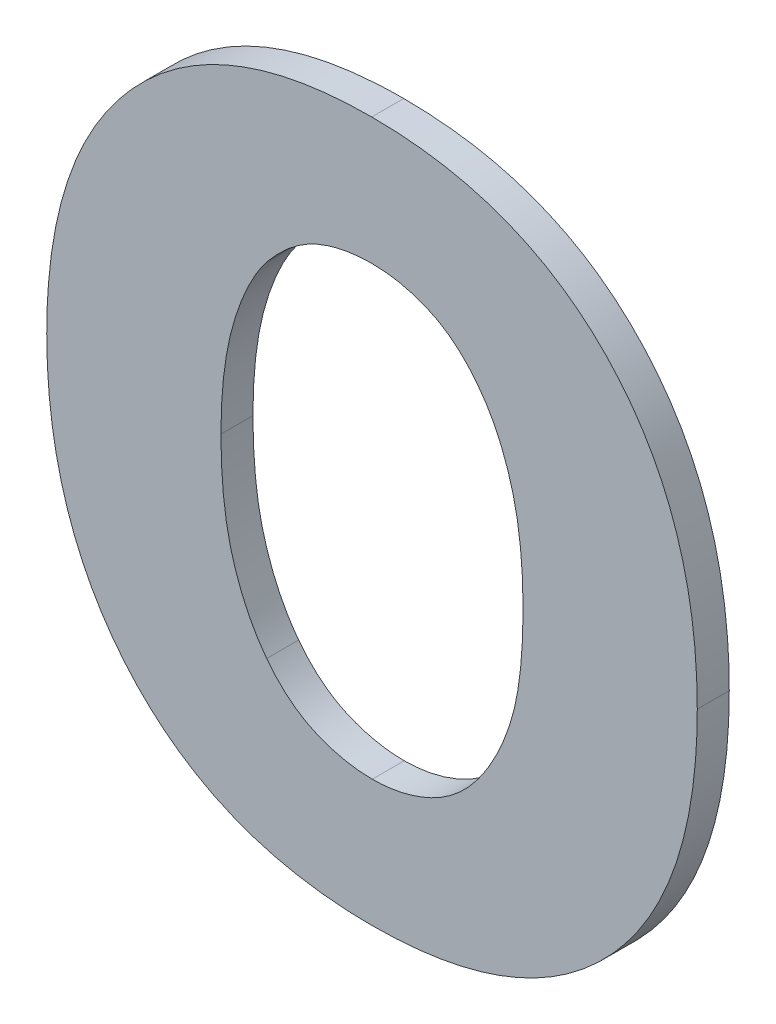
ISO-10303-21;
HEADER;
FILE_DESCRIPTION(('STEP AP214'),'2;1');
FILE_NAME('part.step','',(''),(''),'','','');
FILE_SCHEMA(('AUTOMOTIVE_DESIGN { 1 0 10303 214 1 1 1 1 }'));
ENDSEC;
DATA;
#1=APPLICATION_CONTEXT('core data for automotive mechanical design processes');
#2=APPLICATION_PROTOCOL_DEFINITION('international standard','automotive_design',2000,#1);
#3=PRODUCT_CONTEXT('',#1,'mechanical');
#4=PRODUCT('Part','Part','',(#3));
#5=PRODUCT_RELATED_PRODUCT_CATEGORY('part','',(#4));
#6=PRODUCT_DEFINITION_FORMATION('','',#4);
#7=PRODUCT_DEFINITION_CONTEXT('part definition',#1,'design');
#8=PRODUCT_DEFINITION('design','',#6,#7);
#9=PRODUCT_DEFINITION_SHAPE('','',#8);
#10=(LENGTH_UNIT() NAMED_UNIT(*) SI_UNIT(.MILLI.,.METRE.));
#11=(NAMED_UNIT(*) PLANE_ANGLE_UNIT() SI_UNIT($,.RADIAN.));
#12=(NAMED_UNIT(*) SI_UNIT($,.STERADIAN.) SOLID_ANGLE_UNIT());
#13=UNCERTAINTY_MEASURE_WITH_UNIT(LENGTH_MEASURE(1.E-05),#10,'distance_accuracy_value','');
#14=(GEOMETRIC_REPRESENTATION_CONTEXT(3) GLOBAL_UNCERTAINTY_ASSIGNED_CONTEXT((#13)) GLOBAL_UNIT_ASSIGNED_CONTEXT((#10,
#11,#12)) REPRESENTATION_CONTEXT('',''));
#15=CARTESIAN_POINT('',(0.,0.,0.));
#16=DIRECTION('',(0.,0.,1.));
#17=DIRECTION('',(1.,0.,0.));
#18=AXIS2_PLACEMENT_3D('',#15,#16,#17);
#19=CARTESIAN_POINT('',(3.7394580950312,-3.1596409460892,0.0475));
#20=CARTESIAN_POINT('',(3.7394580950312,-3.1596409460892,0.0525));
#21=CARTESIAN_POINT('',(3.7428616605651,-3.1550461326184,0.0475));
#22=CARTESIAN_POINT('',(3.7428616605651,-3.1550461326184,0.0525));
#23=CARTESIAN_POINT('',(3.7465204935141,-3.1428783858346,0.0475));
#24=CARTESIAN_POINT('',(3.7465204935141,-3.1428783858346,0.0525));
#25=CARTESIAN_POINT('',(3.7465204935141,-3.1330080457862,0.0475));
#26=CARTESIAN_POINT('',(3.7465204935141,-3.1330080457862,0.0525));
#27=B_SPLINE_SURFACE_WITH_KNOTS('',2,1,((#19,#20),(#21,#22),(#23,#24),(#25,#26)),.UNSPECIFIED.,
.F.,.F.,.F.,(3,1,3),(2,2),(0.,1.,2.),(0.,0.01),.UNSPECIFIED.);
#28=CARTESIAN_POINT('',(3.7394580950312,-3.1596409460892,0.0475));
#29=CARTESIAN_POINT('',(3.7428616605651,-3.1550461326184,0.0475));
#30=CARTESIAN_POINT('',(3.7465204935141,-3.1428783858346,0.0475));
#31=CARTESIAN_POINT('',(3.7465204935141,-3.1330080457862,0.0475));
#32=B_SPLINE_CURVE_WITH_KNOTS('',2,(#28,#29,#30,#31),.UNSPECIFIED.,.F.,.F.,(3,1,3),(0.,1.,2.),.UNSPECIFIED.);
#33=CARTESIAN_POINT('',(3.7394580950312,-3.1596409460892,0.0475));
#34=VERTEX_POINT('',#33);
#35=CARTESIAN_POINT('',(3.7465204935141,-3.1330080457862,0.0475));
#36=VERTEX_POINT('',#35);
#37=EDGE_CURVE('E11',#34,#36,#32,.T.);
#38=DIRECTION('',(0.,0.,1.));
#39=VECTOR('',#38,1.);
#40=CARTESIAN_POINT('',(3.7394580950312,-3.1596409460892,0.0475));
#41=LINE('',#40,#39);
#42=CARTESIAN_POINT('',(3.7394580950312,-3.1596409460892,0.0525));
#43=VERTEX_POINT('',#42);
#44=EDGE_CURVE('E28',#34,#43,#41,.T.);
#45=CARTESIAN_POINT('',(3.7465204935141,-3.1330080457862,0.0525));
#46=CARTESIAN_POINT('',(3.7465204935141,-3.1428783858346,0.0525));
#47=CARTESIAN_POINT('',(3.7428616605651,-3.1550461326184,0.0525));
#48=CARTESIAN_POINT('',(3.7394580950312,-3.1596409460892,0.0525));
#49=B_SPLINE_CURVE_WITH_KNOTS('',2,(#45,#46,#47,#48),.UNSPECIFIED.,.F.,.F.,(3,1,3),(-2.,-1.,0.),.UNSPECIFIED.);
#50=CARTESIAN_POINT('',(3.7465204935141,-3.1330080457862,0.0525));
#51=VERTEX_POINT('',#50);
#52=EDGE_CURVE('E317',#51,#43,#49,.T.);
#53=DIRECTION('',(0.,0.,1.));
#54=VECTOR('',#53,1.);
#55=CARTESIAN_POINT('',(3.7465204935141,-3.1330080457862,0.0475));
#56=LINE('',#55,#54);
#57=EDGE_CURVE('E41',#36,#51,#56,.T.);
#58=ORIENTED_EDGE('',*,*,#37,.F.);
#59=ORIENTED_EDGE('',*,*,#44,.T.);
#60=ORIENTED_EDGE('',*,*,#52,.F.);
#61=ORIENTED_EDGE('',*,*,#57,.F.);
#62=EDGE_LOOP('',(#58,#59,#60,#61));
#63=FACE_BOUND('',#62,.T.);
#64=ADVANCED_FACE('F17',(#63),#27,.F.);
#65=CARTESIAN_POINT('',(3.7229508021916,-3.167894592509,0.0475));
#66=CARTESIAN_POINT('',(3.7229508021916,-3.167894592509,0.0525));
#67=CARTESIAN_POINT('',(3.7276307048008,-3.167894592509,0.0475));
#68=CARTESIAN_POINT('',(3.7276307048008,-3.167894592509,0.0525));
#69=CARTESIAN_POINT('',(3.7363097969123,-3.1638954030066,0.0475));
#70=CARTESIAN_POINT('',(3.7363097969123,-3.1638954030066,0.0525));
#71=CARTESIAN_POINT('',(3.7394580950312,-3.1596409460892,0.0475));
#72=CARTESIAN_POINT('',(3.7394580950312,-3.1596409460892,0.0525));
#73=B_SPLINE_SURFACE_WITH_KNOTS('',2,1,((#65,#66),(#67,#68),(#69,#70),(#71,#72)),.UNSPECIFIED.,
.F.,.F.,.F.,(3,1,3),(2,2),(0.,1.,2.),(0.,0.01),.UNSPECIFIED.);
#74=CARTESIAN_POINT('',(3.7229508021916,-3.167894592509,0.0475));
#75=CARTESIAN_POINT('',(3.7276307048008,-3.167894592509,0.0475));
#76=CARTESIAN_POINT('',(3.7363097969123,-3.1638954030066,0.0475));
#77=CARTESIAN_POINT('',(3.7394580950312,-3.1596409460892,0.0475));
#78=B_SPLINE_CURVE_WITH_KNOTS('',2,(#74,#75,#76,#77),.UNSPECIFIED.,.F.,.F.,(3,1,3),(0.,1.,2.),.UNSPECIFIED.);
#79=CARTESIAN_POINT('',(3.7229508021916,-3.167894592509,0.0475));
#80=VERTEX_POINT('',#79);
#81=EDGE_CURVE('E308',#80,#34,#78,.T.);
#82=DIRECTION('',(0.,0.,1.));
#83=VECTOR('',#82,1.);
#84=CARTESIAN_POINT('',(3.7229508021916,-3.167894592509,0.0475));
#85=LINE('',#84,#83);
#86=CARTESIAN_POINT('',(3.7229508021916,-3.167894592509,0.0525));
#87=VERTEX_POINT('',#86);
#88=EDGE_CURVE('E302',#80,#87,#85,.T.);
#89=CARTESIAN_POINT('',(3.7394580950312,-3.1596409460892,0.0525));
#90=CARTESIAN_POINT('',(3.7363097969123,-3.1638954030066,0.0525));
#91=CARTESIAN_POINT('',(3.7276307048008,-3.167894592509,0.0525));
#92=CARTESIAN_POINT('',(3.7229508021916,-3.167894592509,0.0525));
#93=B_SPLINE_CURVE_WITH_KNOTS('',2,(#89,#90,#91,#92),.UNSPECIFIED.,.F.,.F.,(3,1,3),(-2.,-1.,0.),.UNSPECIFIED.);
#94=EDGE_CURVE('E295',#43,#87,#93,.T.);
#95=ORIENTED_EDGE('',*,*,#81,.F.);
#96=ORIENTED_EDGE('',*,*,#88,.T.);
#97=ORIENTED_EDGE('',*,*,#94,.F.);
#98=ORIENTED_EDGE('',*,*,#44,.F.);
#99=EDGE_LOOP('',(#95,#96,#97,#98));
#100=FACE_BOUND('',#99,.T.);
#101=ADVANCED_FACE('F323',(#100),#73,.F.);
#102=CARTESIAN_POINT('',(3.7064435093521,-3.1598111243659,0.0475));
#103=CARTESIAN_POINT('',(3.7064435093521,-3.1598111243659,0.0525));
#104=CARTESIAN_POINT('',(3.7097619857476,-3.1641506704217,0.0475));
#105=CARTESIAN_POINT('',(3.7097619857476,-3.1641506704217,0.0525));
#106=CARTESIAN_POINT('',(3.7183559887208,-3.167894592509,0.0475));
#107=CARTESIAN_POINT('',(3.7183559887208,-3.167894592509,0.0525));
#108=CARTESIAN_POINT('',(3.7229508021916,-3.167894592509,0.0475));
#109=CARTESIAN_POINT('',(3.7229508021916,-3.167894592509,0.0525));
#110=B_SPLINE_SURFACE_WITH_KNOTS('',2,1,((#102,#103),(#104,#105),(#106,#107),(#108,#109)),
.UNSPECIFIED.,.F.,.F.,.F.,(3,1,3),(2,2),(0.,1.,2.),(0.,0.01),.UNSPECIFIED.);
#111=CARTESIAN_POINT('',(3.7064435093521,-3.1598111243659,0.0475));
#112=CARTESIAN_POINT('',(3.7097619857476,-3.1641506704217,0.0475));
#113=CARTESIAN_POINT('',(3.7183559887208,-3.167894592509,0.0475));
#114=CARTESIAN_POINT('',(3.7229508021916,-3.167894592509,0.0475));
#115=B_SPLINE_CURVE_WITH_KNOTS('',2,(#111,#112,#113,#114),.UNSPECIFIED.,.F.,.F.,(3,1,3),(0.,1.,
2.),.UNSPECIFIED.);
#116=CARTESIAN_POINT('',(3.7064435093521,-3.1598111243659,0.0475));
#117=VERTEX_POINT('',#116);
#118=EDGE_CURVE('E290',#117,#80,#115,.T.);
#119=DIRECTION('',(0.,0.,1.));
#120=VECTOR('',#119,1.);
#121=CARTESIAN_POINT('',(3.7064435093521,-3.1598111243659,0.0475));
#122=LINE('',#121,#120);
#123=CARTESIAN_POINT('',(3.7064435093521,-3.1598111243659,0.0525));
#124=VERTEX_POINT('',#123);
#125=EDGE_CURVE('E284',#117,#124,#122,.T.);
#126=CARTESIAN_POINT('',(3.7229508021916,-3.167894592509,0.0525));
#127=CARTESIAN_POINT('',(3.7183559887208,-3.167894592509,0.0525));
#128=CARTESIAN_POINT('',(3.7097619857476,-3.1641506704217,0.0525));
#129=CARTESIAN_POINT('',(3.7064435093521,-3.1598111243659,0.0525));
#130=B_SPLINE_CURVE_WITH_KNOTS('',2,(#126,#127,#128,#129),.UNSPECIFIED.,.F.,.F.,(3,1,3),(-2.,
-1.,0.),.UNSPECIFIED.);
#131=EDGE_CURVE('E277',#87,#124,#130,.T.);
#132=ORIENTED_EDGE('',*,*,#118,.F.);
#133=ORIENTED_EDGE('',*,*,#125,.T.);
#134=ORIENTED_EDGE('',*,*,#131,.F.);
#135=ORIENTED_EDGE('',*,*,#88,.F.);
#136=EDGE_LOOP('',(#132,#133,#134,#135));
#137=FACE_BOUND('',#136,.T.);
#138=ADVANCED_FACE('F336',(#137),#110,.F.);
#139=CARTESIAN_POINT('',(3.6992960217308,-3.1330080457862,0.0475));
#140=CARTESIAN_POINT('',(3.6992960217308,-3.1330080457862,0.0525));
#141=CARTESIAN_POINT('',(3.6992960217308,-3.1427082075579,0.0475));
#142=CARTESIAN_POINT('',(3.6992960217308,-3.1427082075579,0.0525));
#143=CARTESIAN_POINT('',(3.7031250329565,-3.1554715783102,0.0475));
#144=CARTESIAN_POINT('',(3.7031250329565,-3.1554715783102,0.0525));
#145=CARTESIAN_POINT('',(3.7064435093521,-3.1598111243659,0.0475));
#146=CARTESIAN_POINT('',(3.7064435093521,-3.1598111243659,0.0525));
#147=B_SPLINE_SURFACE_WITH_KNOTS('',2,1,((#139,#140),(#141,#142),(#143,#144),(#145,#146)),
.UNSPECIFIED.,.F.,.F.,.F.,(3,1,3),(2,2),(0.,1.,2.),(0.,0.01),.UNSPECIFIED.);
#148=CARTESIAN_POINT('',(3.6992960217308,-3.1330080457862,0.0475));
#149=CARTESIAN_POINT('',(3.6992960217308,-3.1427082075579,0.0475));
#150=CARTESIAN_POINT('',(3.7031250329565,-3.1554715783102,0.0475));
#151=CARTESIAN_POINT('',(3.7064435093521,-3.1598111243659,0.0475));
#152=B_SPLINE_CURVE_WITH_KNOTS('',2,(#148,#149,#150,#151),.UNSPECIFIED.,.F.,.F.,(3,1,3),(0.,1.,
2.),.UNSPECIFIED.);
#153=CARTESIAN_POINT('',(3.6992960217308,-3.1330080457862,0.0475));
#154=VERTEX_POINT('',#153);
#155=EDGE_CURVE('E272',#154,#117,#152,.T.);
#156=DIRECTION('',(0.,0.,1.));
#157=VECTOR('',#156,1.);
#158=CARTESIAN_POINT('',(3.6992960217308,-3.1330080457862,0.0475));
#159=LINE('',#158,#157);
#160=CARTESIAN_POINT('',(3.6992960217308,-3.1330080457862,0.0525));
#161=VERTEX_POINT('',#160);
#162=EDGE_CURVE('E266',#154,#161,#159,.T.);
#163=CARTESIAN_POINT('',(3.7064435093521,-3.1598111243659,0.0525));
#164=CARTESIAN_POINT('',(3.7031250329565,-3.1554715783102,0.0525));
#165=CARTESIAN_POINT('',(3.6992960217308,-3.1427082075579,0.0525));
#166=CARTESIAN_POINT('',(3.6992960217308,-3.1330080457862,0.0525));
#167=B_SPLINE_CURVE_WITH_KNOTS('',2,(#163,#164,#165,#166),.UNSPECIFIED.,.F.,.F.,(3,1,3),(-2.,
-1.,0.),.UNSPECIFIED.);
#168=EDGE_CURVE('E259',#124,#161,#167,.T.);
#169=ORIENTED_EDGE('',*,*,#155,.F.);
#170=ORIENTED_EDGE('',*,*,#162,.T.);
#171=ORIENTED_EDGE('',*,*,#168,.F.);
#172=ORIENTED_EDGE('',*,*,#125,.F.);
#173=EDGE_LOOP('',(#169,#170,#171,#172));
#174=FACE_BOUND('',#173,.T.);
#175=ADVANCED_FACE('F339',(#174),#147,.F.);
#176=CARTESIAN_POINT('',(3.7065285984904,-3.1060347889298,0.0475));
#177=CARTESIAN_POINT('',(3.7065285984904,-3.1060347889298,0.0525));
#178=CARTESIAN_POINT('',(3.7032952112332,-3.1101190675706,0.0475));
#179=CARTESIAN_POINT('',(3.7032952112332,-3.1101190675706,0.0525));
#180=CARTESIAN_POINT('',(3.6992960217308,-3.1236482405679,0.0475));
#181=CARTESIAN_POINT('',(3.6992960217308,-3.1236482405679,0.0525));
#182=CARTESIAN_POINT('',(3.6992960217308,-3.1330080457862,0.0475));
#183=CARTESIAN_POINT('',(3.6992960217308,-3.1330080457862,0.0525));
#184=B_SPLINE_SURFACE_WITH_KNOTS('',2,1,((#176,#177),(#178,#179),(#180,#181),(#182,#183)),
.UNSPECIFIED.,.F.,.F.,.F.,(3,1,3),(2,2),(0.,1.,2.),(0.,0.01),.UNSPECIFIED.);
#185=CARTESIAN_POINT('',(3.7065285984904,-3.1060347889298,0.0475));
#186=CARTESIAN_POINT('',(3.7032952112332,-3.1101190675706,0.0475));
#187=CARTESIAN_POINT('',(3.6992960217308,-3.1236482405679,0.0475));
#188=CARTESIAN_POINT('',(3.6992960217308,-3.1330080457862,0.0475));
#189=B_SPLINE_CURVE_WITH_KNOTS('',2,(#185,#186,#187,#188),.UNSPECIFIED.,.F.,.F.,(3,1,3),(0.,1.,
2.),.UNSPECIFIED.);
#190=CARTESIAN_POINT('',(3.7065285984904,-3.1060347889298,0.0475));
#191=VERTEX_POINT('',#190);
#192=EDGE_CURVE('E254',#191,#154,#189,.T.);
#193=DIRECTION('',(0.,0.,1.));
#194=VECTOR('',#193,1.);
#195=CARTESIAN_POINT('',(3.7065285984904,-3.1060347889298,0.0475));
#196=LINE('',#195,#194);
#197=CARTESIAN_POINT('',(3.7065285984904,-3.1060347889298,0.0525));
#198=VERTEX_POINT('',#197);
#199=EDGE_CURVE('E248',#191,#198,#196,.T.);
#200=CARTESIAN_POINT('',(3.6992960217308,-3.1330080457862,0.0525));
#201=CARTESIAN_POINT('',(3.6992960217308,-3.1236482405679,0.0525));
#202=CARTESIAN_POINT('',(3.7032952112332,-3.1101190675706,0.0525));
#203=CARTESIAN_POINT('',(3.7065285984904,-3.1060347889298,0.0525));
#204=B_SPLINE_CURVE_WITH_KNOTS('',2,(#200,#201,#202,#203),.UNSPECIFIED.,.F.,.F.,(3,1,3),(-2.,
-1.,0.),.UNSPECIFIED.);
#205=EDGE_CURVE('E241',#161,#198,#204,.T.);
#206=ORIENTED_EDGE('',*,*,#192,.F.);
#207=ORIENTED_EDGE('',*,*,#199,.T.);
#208=ORIENTED_EDGE('',*,*,#205,.F.);
#209=ORIENTED_EDGE('',*,*,#162,.F.);
#210=EDGE_LOOP('',(#206,#207,#208,#209));
#211=FACE_BOUND('',#210,.T.);
#212=ADVANCED_FACE('F344',(#211),#184,.F.);
#213=CARTESIAN_POINT('',(3.7229508021916,-3.0981214990634,0.0475));
#214=CARTESIAN_POINT('',(3.7229508021916,-3.0981214990634,0.0525));
#215=CARTESIAN_POINT('',(3.7181007213058,-3.0981214990634,0.0475));
#216=CARTESIAN_POINT('',(3.7181007213058,-3.0981214990634,0.0525));
#217=CARTESIAN_POINT('',(3.7101874314394,-3.1016101537357,0.0475));
#218=CARTESIAN_POINT('',(3.7101874314394,-3.1016101537357,0.0525));
#219=CARTESIAN_POINT('',(3.7065285984904,-3.1060347889298,0.0475));
#220=CARTESIAN_POINT('',(3.7065285984904,-3.1060347889298,0.0525));
#221=B_SPLINE_SURFACE_WITH_KNOTS('',2,1,((#213,#214),(#215,#216),(#217,#218),(#219,#220)),
.UNSPECIFIED.,.F.,.F.,.F.,(3,1,3),(2,2),(0.,1.,2.),(0.,0.01),.UNSPECIFIED.);
#222=CARTESIAN_POINT('',(3.7229508021916,-3.0981214990634,0.0475));
#223=CARTESIAN_POINT('',(3.7181007213058,-3.0981214990634,0.0475));
#224=CARTESIAN_POINT('',(3.7101874314394,-3.1016101537357,0.0475));
#225=CARTESIAN_POINT('',(3.7065285984904,-3.1060347889298,0.0475));
#226=B_SPLINE_CURVE_WITH_KNOTS('',2,(#222,#223,#224,#225),.UNSPECIFIED.,.F.,.F.,(3,1,3),(0.,1.,
2.),.UNSPECIFIED.);
#227=CARTESIAN_POINT('',(3.7229508021916,-3.0981214990634,0.0475));
#228=VERTEX_POINT('',#227);
#229=EDGE_CURVE('E236',#228,#191,#226,.T.);
#230=DIRECTION('',(0.,0.,1.));
#231=VECTOR('',#230,1.);
#232=CARTESIAN_POINT('',(3.7229508021916,-3.0981214990634,0.0475));
#233=LINE('',#232,#231);
#234=CARTESIAN_POINT('',(3.7229508021916,-3.0981214990634,0.0525));
#235=VERTEX_POINT('',#234);
#236=EDGE_CURVE('E230',#228,#235,#233,.T.);
#237=CARTESIAN_POINT('',(3.7065285984904,-3.1060347889298,0.0525));
#238=CARTESIAN_POINT('',(3.7101874314394,-3.1016101537357,0.0525));
#239=CARTESIAN_POINT('',(3.7181007213058,-3.0981214990634,0.0525));
#240=CARTESIAN_POINT('',(3.7229508021916,-3.0981214990634,0.0525));
#241=B_SPLINE_CURVE_WITH_KNOTS('',2,(#237,#238,#239,#240),.UNSPECIFIED.,.F.,.F.,(3,1,3),(-2.,
-1.,0.),.UNSPECIFIED.);
#242=EDGE_CURVE('E223',#198,#235,#241,.T.);
#243=ORIENTED_EDGE('',*,*,#229,.F.);
#244=ORIENTED_EDGE('',*,*,#236,.T.);
#245=ORIENTED_EDGE('',*,*,#242,.F.);
#246=ORIENTED_EDGE('',*,*,#199,.F.);
#247=EDGE_LOOP('',(#243,#244,#245,#246));
#248=FACE_BOUND('',#247,.T.);
#249=ADVANCED_FACE('F347',(#248),#221,.F.);
#250=CARTESIAN_POINT('',(3.7393730058928,-3.1062049672065,0.0475));
#251=CARTESIAN_POINT('',(3.7393730058928,-3.1062049672065,0.0525));
#252=CARTESIAN_POINT('',(3.7360545294973,-3.1018654211508,0.0475));
#253=CARTESIAN_POINT('',(3.7360545294973,-3.1018654211508,0.0525));
#254=CARTESIAN_POINT('',(3.7275456156624,-3.0981214990634,0.0475));
#255=CARTESIAN_POINT('',(3.7275456156624,-3.0981214990634,0.0525));
#256=CARTESIAN_POINT('',(3.7229508021916,-3.0981214990634,0.0475));
#257=CARTESIAN_POINT('',(3.7229508021916,-3.0981214990634,0.0525));
#258=B_SPLINE_SURFACE_WITH_KNOTS('',2,1,((#250,#251),(#252,#253),(#254,#255),(#256,#257)),
.UNSPECIFIED.,.F.,.F.,.F.,(3,1,3),(2,2),(0.,1.,2.),(0.,0.01),.UNSPECIFIED.);
#259=CARTESIAN_POINT('',(3.7393730058928,-3.1062049672065,0.0475));
#260=CARTESIAN_POINT('',(3.7360545294973,-3.1018654211508,0.0475));
#261=CARTESIAN_POINT('',(3.7275456156624,-3.0981214990634,0.0475));
#262=CARTESIAN_POINT('',(3.7229508021916,-3.0981214990634,0.0475));
#263=B_SPLINE_CURVE_WITH_KNOTS('',2,(#259,#260,#261,#262),.UNSPECIFIED.,.F.,.F.,(3,1,3),(0.,1.,
2.),.UNSPECIFIED.);
#264=CARTESIAN_POINT('',(3.7393730058928,-3.1062049672065,0.0475));
#265=VERTEX_POINT('',#264);
#266=EDGE_CURVE('E218',#265,#228,#263,.T.);
#267=DIRECTION('',(0.,0.,1.));
#268=VECTOR('',#267,1.);
#269=CARTESIAN_POINT('',(3.7393730058928,-3.1062049672065,0.0475));
#270=LINE('',#269,#268);
#271=CARTESIAN_POINT('',(3.7393730058928,-3.1062049672065,0.0525));
#272=VERTEX_POINT('',#271);
#273=EDGE_CURVE('E212',#265,#272,#270,.T.);
#274=CARTESIAN_POINT('',(3.7229508021916,-3.0981214990634,0.0525));
#275=CARTESIAN_POINT('',(3.7275456156624,-3.0981214990634,0.0525));
#276=CARTESIAN_POINT('',(3.7360545294973,-3.1018654211508,0.0525));
#277=CARTESIAN_POINT('',(3.7393730058928,-3.1062049672065,0.0525));
#278=B_SPLINE_CURVE_WITH_KNOTS('',2,(#274,#275,#276,#277),.UNSPECIFIED.,.F.,.F.,(3,1,3),(-2.,
-1.,0.),.UNSPECIFIED.);
#279=EDGE_CURVE('E205',#235,#272,#278,.T.);
#280=ORIENTED_EDGE('',*,*,#266,.F.);
#281=ORIENTED_EDGE('',*,*,#273,.T.);
#282=ORIENTED_EDGE('',*,*,#279,.F.);
#283=ORIENTED_EDGE('',*,*,#236,.F.);
#284=EDGE_LOOP('',(#280,#281,#282,#283));
#285=FACE_BOUND('',#284,.T.);
#286=ADVANCED_FACE('F349',(#285),#258,.F.);
#287=CARTESIAN_POINT('',(3.7465204935141,-3.1330080457862,0.0475));
#288=CARTESIAN_POINT('',(3.7465204935141,-3.1330080457862,0.0525));
#289=CARTESIAN_POINT('',(3.7465204935141,-3.1235631514296,0.0475));
#290=CARTESIAN_POINT('',(3.7465204935141,-3.1235631514296,0.0525));
#291=CARTESIAN_POINT('',(3.7426914822884,-3.1103743349856,0.0475));
#292=CARTESIAN_POINT('',(3.7426914822884,-3.1103743349856,0.0525));
#293=CARTESIAN_POINT('',(3.7393730058928,-3.1062049672065,0.0475));
#294=CARTESIAN_POINT('',(3.7393730058928,-3.1062049672065,0.0525));
#295=B_SPLINE_SURFACE_WITH_KNOTS('',2,1,((#287,#288),(#289,#290),(#291,#292),(#293,#294)),
.UNSPECIFIED.,.F.,.F.,.F.,(3,1,3),(2,2),(0.,1.,2.),(0.,0.01),.UNSPECIFIED.);
#296=CARTESIAN_POINT('',(3.7465204935141,-3.1330080457862,0.0475));
#297=CARTESIAN_POINT('',(3.7465204935141,-3.1235631514296,0.0475));
#298=CARTESIAN_POINT('',(3.7426914822884,-3.1103743349856,0.0475));
#299=CARTESIAN_POINT('',(3.7393730058928,-3.1062049672065,0.0475));
#300=B_SPLINE_CURVE_WITH_KNOTS('',2,(#296,#297,#298,#299),.UNSPECIFIED.,.F.,.F.,(3,1,3),(0.,1.,
2.),.UNSPECIFIED.);
#301=EDGE_CURVE('E197',#36,#265,#300,.T.);
#302=CARTESIAN_POINT('',(3.7393730058928,-3.1062049672065,0.0525));
#303=CARTESIAN_POINT('',(3.7426914822884,-3.1103743349856,0.0525));
#304=CARTESIAN_POINT('',(3.7465204935141,-3.1235631514296,0.0525));
#305=CARTESIAN_POINT('',(3.7465204935141,-3.1330080457862,0.0525));
#306=B_SPLINE_CURVE_WITH_KNOTS('',2,(#302,#303,#304,#305),.UNSPECIFIED.,.F.,.F.,(3,1,3),(-2.,
-1.,0.),.UNSPECIFIED.);
#307=EDGE_CURVE('E189',#272,#51,#306,.T.);
#308=ORIENTED_EDGE('',*,*,#301,.F.);
#309=ORIENTED_EDGE('',*,*,#57,.T.);
#310=ORIENTED_EDGE('',*,*,#307,.F.);
#311=ORIENTED_EDGE('',*,*,#273,.F.);
#312=EDGE_LOOP('',(#308,#309,#310,#311));
#313=FACE_BOUND('',#312,.T.);
#314=ADVANCED_FACE('F329',(#313),#295,.F.);
#315=CARTESIAN_POINT('',(3.6720674974594,-3.1330080457862,0.0475));
#316=CARTESIAN_POINT('',(3.6720674974594,-3.1330080457862,0.0525));
#317=CARTESIAN_POINT('',(3.6720674974594,-3.1581944307373,0.0475));
#318=CARTESIAN_POINT('',(3.6720674974594,-3.1581944307373,0.0525));
#319=CARTESIAN_POINT('',(3.6991258434541,-3.1877203617442,0.0475));
#320=CARTESIAN_POINT('',(3.6991258434541,-3.1877203617442,0.0525));
#321=CARTESIAN_POINT('',(3.7228657130533,-3.1877203617442,0.0475));
#322=CARTESIAN_POINT('',(3.7228657130533,-3.1877203617442,0.0525));
#323=B_SPLINE_SURFACE_WITH_KNOTS('',2,1,((#315,#316),(#317,#318),(#319,#320),(#321,#322)),
.UNSPECIFIED.,.F.,.F.,.F.,(3,1,3),(2,2),(-2.,-1.,0.),(0.,0.01),.UNSPECIFIED.);
#324=CARTESIAN_POINT('',(3.7228657130533,-3.1877203617442,0.0475));
#325=CARTESIAN_POINT('',(3.6991258434541,-3.1877203617442,0.0475));
#326=CARTESIAN_POINT('',(3.6720674974594,-3.1581944307373,0.0475));
#327=CARTESIAN_POINT('',(3.6720674974594,-3.1330080457862,0.0475));
#328=B_SPLINE_CURVE_WITH_KNOTS('',2,(#324,#325,#326,#327),.UNSPECIFIED.,.F.,.F.,(3,1,3),(0.,1.,
2.),.UNSPECIFIED.);
#329=CARTESIAN_POINT('',(3.7228657130533,-3.1877203617442,0.0475));
#330=VERTEX_POINT('',#329);
#331=CARTESIAN_POINT('',(3.6720674974594,-3.1330080457862,0.0475));
#332=VERTEX_POINT('',#331);
#333=EDGE_CURVE('E185',#330,#332,#328,.T.);
#334=DIRECTION('',(0.,0.,1.));
#335=VECTOR('',#334,1.);
#336=CARTESIAN_POINT('',(3.7228657130533,-3.1877203617442,0.0475));
#337=LINE('',#336,#335);
#338=CARTESIAN_POINT('',(3.7228657130533,-3.1877203617442,0.0525));
#339=VERTEX_POINT('',#338);
#340=EDGE_CURVE('E180',#330,#339,#337,.T.);
#341=CARTESIAN_POINT('',(3.6720674974594,-3.1330080457862,0.0525));
#342=CARTESIAN_POINT('',(3.6720674974594,-3.1581944307373,0.0525));
#343=CARTESIAN_POINT('',(3.6991258434541,-3.1877203617442,0.0525));
#344=CARTESIAN_POINT('',(3.7228657130533,-3.1877203617442,0.0525));
#345=B_SPLINE_CURVE_WITH_KNOTS('',2,(#341,#342,#343,#344),.UNSPECIFIED.,.F.,.F.,(3,1,3),(-2.,
-1.,0.),.UNSPECIFIED.);
#346=CARTESIAN_POINT('',(3.6720674974594,-3.1330080457862,0.0525));
#347=VERTEX_POINT('',#346);
#348=EDGE_CURVE('E134',#347,#339,#345,.T.);
#349=DIRECTION('',(0.,0.,1.));
#350=VECTOR('',#349,1.);
#351=CARTESIAN_POINT('',(3.6720674974594,-3.1330080457862,0.0475));
#352=LINE('',#351,#350);
#353=EDGE_CURVE('E171',#332,#347,#352,.T.);
#354=ORIENTED_EDGE('',*,*,#333,.F.);
#355=ORIENTED_EDGE('',*,*,#340,.T.);
#356=ORIENTED_EDGE('',*,*,#348,.F.);
#357=ORIENTED_EDGE('',*,*,#353,.F.);
#358=EDGE_LOOP('',(#354,#355,#356,#357));
#359=FACE_BOUND('',#358,.T.);
#360=ADVANCED_FACE('F357',(#359),#323,.T.);
#361=CARTESIAN_POINT('',(3.7228657130533,-3.0782957298283,0.0475));
#362=CARTESIAN_POINT('',(3.7228657130533,-3.0782957298283,0.0525));
#363=CARTESIAN_POINT('',(3.6991258434541,-3.0782957298283,0.0475));
#364=CARTESIAN_POINT('',(3.6991258434541,-3.0782957298283,0.0525));
#365=CARTESIAN_POINT('',(3.6720674974594,-3.1077365716968,0.0475));
#366=CARTESIAN_POINT('',(3.6720674974594,-3.1077365716968,0.0525));
#367=CARTESIAN_POINT('',(3.6720674974594,-3.1330080457862,0.0475));
#368=CARTESIAN_POINT('',(3.6720674974594,-3.1330080457862,0.0525));
#369=B_SPLINE_SURFACE_WITH_KNOTS('',2,1,((#361,#362),(#363,#364),(#365,#366),(#367,#368)),
.UNSPECIFIED.,.F.,.F.,.F.,(3,1,3),(2,2),(-2.,-1.,0.),(0.,0.01),.UNSPECIFIED.);
#370=CARTESIAN_POINT('',(3.6720674974594,-3.1330080457862,0.0475));
#371=CARTESIAN_POINT('',(3.6720674974594,-3.1077365716968,0.0475));
#372=CARTESIAN_POINT('',(3.6991258434541,-3.0782957298283,0.0475));
#373=CARTESIAN_POINT('',(3.7228657130533,-3.0782957298283,0.0475));
#374=B_SPLINE_CURVE_WITH_KNOTS('',2,(#370,#371,#372,#373),.UNSPECIFIED.,.F.,.F.,(3,1,3),(0.,1.,
2.),.UNSPECIFIED.);
#375=CARTESIAN_POINT('',(3.7228657130533,-3.0782957298283,0.0475));
#376=VERTEX_POINT('',#375);
#377=EDGE_CURVE('E164',#332,#376,#374,.T.);
#378=CARTESIAN_POINT('',(3.7228657130533,-3.0782957298283,0.0525));
#379=CARTESIAN_POINT('',(3.6991258434541,-3.0782957298283,0.0525));
#380=CARTESIAN_POINT('',(3.6720674974594,-3.1077365716968,0.0525));
#381=CARTESIAN_POINT('',(3.6720674974594,-3.1330080457862,0.0525));
#382=B_SPLINE_CURVE_WITH_KNOTS('',2,(#378,#379,#380,#381),.UNSPECIFIED.,.F.,.F.,(3,1,3),(-2.,
-1.,0.),.UNSPECIFIED.);
#383=CARTESIAN_POINT('',(3.7228657130533,-3.0782957298283,0.0525));
#384=VERTEX_POINT('',#383);
#385=EDGE_CURVE('E160',#384,#347,#382,.T.);
#386=DIRECTION('',(0.,0.,1.));
#387=VECTOR('',#386,1.);
#388=CARTESIAN_POINT('',(3.7228657130533,-3.0782957298283,0.0475));
#389=LINE('',#388,#387);
#390=EDGE_CURVE('E117',#376,#384,#389,.T.);
#391=ORIENTED_EDGE('',*,*,#377,.F.);
#392=ORIENTED_EDGE('',*,*,#353,.T.);
#393=ORIENTED_EDGE('',*,*,#385,.F.);
#394=ORIENTED_EDGE('',*,*,#390,.F.);
#395=EDGE_LOOP('',(#391,#392,#393,#394));
#396=FACE_BOUND('',#395,.T.);
#397=ADVANCED_FACE('F441',(#396),#369,.T.);
#398=CARTESIAN_POINT('',(3.7737490177855,-3.1330080457862,0.0475));
#399=CARTESIAN_POINT('',(3.7737490177855,-3.1330080457862,0.0525));
#400=CARTESIAN_POINT('',(3.7737490177855,-3.1075663934201,0.0475));
#401=CARTESIAN_POINT('',(3.7737490177855,-3.1075663934201,0.0525));
#402=CARTESIAN_POINT('',(3.7465204935141,-3.0782957298283,0.0475));
#403=CARTESIAN_POINT('',(3.7465204935141,-3.0782957298283,0.0525));
#404=CARTESIAN_POINT('',(3.7228657130533,-3.0782957298283,0.0475));
#405=CARTESIAN_POINT('',(3.7228657130533,-3.0782957298283,0.0525));
#406=B_SPLINE_SURFACE_WITH_KNOTS('',2,1,((#398,#399),(#400,#401),(#402,#403),(#404,#405)),
.UNSPECIFIED.,.F.,.F.,.F.,(3,1,3),(2,2),(-2.,-1.,0.),(0.,0.01),.UNSPECIFIED.);
#407=CARTESIAN_POINT('',(3.7228657130533,-3.0782957298283,0.0475));
#408=CARTESIAN_POINT('',(3.7465204935141,-3.0782957298283,0.0475));
#409=CARTESIAN_POINT('',(3.7737490177855,-3.1075663934201,0.0475));
#410=CARTESIAN_POINT('',(3.7737490177855,-3.1330080457862,0.0475));
#411=B_SPLINE_CURVE_WITH_KNOTS('',2,(#407,#408,#409,#410),.UNSPECIFIED.,.F.,.F.,(3,1,3),(0.,1.,
2.),.UNSPECIFIED.);
#412=CARTESIAN_POINT('',(3.7737490177855,-3.1330080457862,0.0475));
#413=VERTEX_POINT('',#412);
#414=EDGE_CURVE('E121',#376,#413,#411,.T.);
#415=CARTESIAN_POINT('',(3.7737490177855,-3.1330080457862,0.0525));
#416=CARTESIAN_POINT('',(3.7737490177855,-3.1075663934201,0.0525));
#417=CARTESIAN_POINT('',(3.7465204935141,-3.0782957298283,0.0525));
#418=CARTESIAN_POINT('',(3.7228657130533,-3.0782957298283,0.0525));
#419=B_SPLINE_CURVE_WITH_KNOTS('',2,(#415,#416,#417,#418),.UNSPECIFIED.,.F.,.F.,(3,1,3),(-2.,
-1.,0.),.UNSPECIFIED.);
#420=CARTESIAN_POINT('',(3.7737490177855,-3.1330080457862,0.0525));
#421=VERTEX_POINT('',#420);
#422=EDGE_CURVE('E110',#421,#384,#419,.T.);
#423=DIRECTION('',(0.,0.,1.));
#424=VECTOR('',#423,1.);
#425=CARTESIAN_POINT('',(3.7737490177855,-3.1330080457862,0.0475));
#426=LINE('',#425,#424);
#427=EDGE_CURVE('E114',#413,#421,#426,.T.);
#428=ORIENTED_EDGE('',*,*,#414,.F.);
#429=ORIENTED_EDGE('',*,*,#390,.T.);
#430=ORIENTED_EDGE('',*,*,#422,.F.);
#431=ORIENTED_EDGE('',*,*,#427,.F.);
#432=EDGE_LOOP('',(#428,#429,#430,#431));
#433=FACE_BOUND('',#432,.T.);
#434=ADVANCED_FACE('F113',(#433),#406,.T.);
#435=CARTESIAN_POINT('',(3.7228657130533,-3.1877203617442,0.0475));
#436=CARTESIAN_POINT('',(3.7228657130533,-3.1877203617442,0.0525));
#437=CARTESIAN_POINT('',(3.7465204935141,-3.1877203617442,0.0475));
#438=CARTESIAN_POINT('',(3.7465204935141,-3.1877203617442,0.0525));
#439=CARTESIAN_POINT('',(3.7737490177855,-3.1585347872907,0.0475));
#440=CARTESIAN_POINT('',(3.7737490177855,-3.1585347872907,0.0525));
#441=CARTESIAN_POINT('',(3.7737490177855,-3.1330080457862,0.0475));
#442=CARTESIAN_POINT('',(3.7737490177855,-3.1330080457862,0.0525));
#443=B_SPLINE_SURFACE_WITH_KNOTS('',2,1,((#435,#436),(#437,#438),(#439,#440),(#441,#442)),
.UNSPECIFIED.,.F.,.F.,.F.,(3,1,3),(2,2),(-2.,-1.,0.),(0.,0.01),.UNSPECIFIED.);
#444=CARTESIAN_POINT('',(3.7737490177855,-3.1330080457862,0.0475));
#445=CARTESIAN_POINT('',(3.7737490177855,-3.1585347872907,0.0475));
#446=CARTESIAN_POINT('',(3.7465204935141,-3.1877203617442,0.0475));
#447=CARTESIAN_POINT('',(3.7228657130533,-3.1877203617442,0.0475));
#448=B_SPLINE_CURVE_WITH_KNOTS('',2,(#444,#445,#446,#447),.UNSPECIFIED.,.F.,.F.,(3,1,3),(0.,1.,
2.),.UNSPECIFIED.);
#449=EDGE_CURVE('E129',#413,#330,#448,.T.);
#450=CARTESIAN_POINT('',(3.7228657130533,-3.1877203617442,0.0525));
#451=CARTESIAN_POINT('',(3.7465204935141,-3.1877203617442,0.0525));
#452=CARTESIAN_POINT('',(3.7737490177855,-3.1585347872907,0.0525));
#453=CARTESIAN_POINT('',(3.7737490177855,-3.1330080457862,0.0525));
#454=B_SPLINE_CURVE_WITH_KNOTS('',2,(#450,#451,#452,#453),.UNSPECIFIED.,.F.,.F.,(3,1,3),(-2.,
-1.,0.),.UNSPECIFIED.);
#455=EDGE_CURVE('E127',#339,#421,#454,.T.);
#456=ORIENTED_EDGE('',*,*,#449,.F.);
#457=ORIENTED_EDGE('',*,*,#427,.T.);
#458=ORIENTED_EDGE('',*,*,#455,.F.);
#459=ORIENTED_EDGE('',*,*,#340,.F.);
#460=EDGE_LOOP('',(#456,#457,#458,#459));
#461=FACE_BOUND('',#460,.T.);
#462=ADVANCED_FACE('F125',(#461),#443,.T.);
#463=CARTESIAN_POINT('',(3.7229181338803,-3.1330080889374,0.0475));
#464=DIRECTION('',(0.,0.,1.));
#465=DIRECTION('',(1.,0.,0.));
#466=AXIS2_PLACEMENT_3D('',#463,#464,#465);
#467=PLANE('',#466);
#468=ORIENTED_EDGE('',*,*,#449,.T.);
#469=ORIENTED_EDGE('',*,*,#333,.T.);
#470=ORIENTED_EDGE('',*,*,#377,.T.);
#471=ORIENTED_EDGE('',*,*,#414,.T.);
#472=EDGE_LOOP('',(#468,#469,#470,#471));
#473=FACE_BOUND('',#472,.T.);
#474=ORIENTED_EDGE('',*,*,#37,.T.);
#475=ORIENTED_EDGE('',*,*,#301,.T.);
#476=ORIENTED_EDGE('',*,*,#266,.T.);
#477=ORIENTED_EDGE('',*,*,#229,.T.);
#478=ORIENTED_EDGE('',*,*,#192,.T.);
#479=ORIENTED_EDGE('',*,*,#155,.T.);
#480=ORIENTED_EDGE('',*,*,#118,.T.);
#481=ORIENTED_EDGE('',*,*,#81,.T.);
#482=EDGE_LOOP('',(#474,#475,#476,#477,#478,#479,#480,#481));
#483=FACE_BOUND('',#482,.T.);
#484=ADVANCED_FACE('F332',(#473,#483),#467,.F.);
#485=CARTESIAN_POINT('',(3.7229181338803,-3.1330080889374,0.0525));
#486=DIRECTION('',(0.,0.,1.));
#487=DIRECTION('',(1.,0.,0.));
#488=AXIS2_PLACEMENT_3D('',#485,#486,#487);
#489=PLANE('',#488);
#490=ORIENTED_EDGE('',*,*,#455,.T.);
#491=ORIENTED_EDGE('',*,*,#422,.T.);
#492=ORIENTED_EDGE('',*,*,#385,.T.);
#493=ORIENTED_EDGE('',*,*,#348,.T.);
#494=EDGE_LOOP('',(#490,#491,#492,#493));
#495=FACE_BOUND('',#494,.T.);
#496=ORIENTED_EDGE('',*,*,#52,.T.);
#497=ORIENTED_EDGE('',*,*,#94,.T.);
#498=ORIENTED_EDGE('',*,*,#131,.T.);
#499=ORIENTED_EDGE('',*,*,#168,.T.);
#500=ORIENTED_EDGE('',*,*,#205,.T.);
#501=ORIENTED_EDGE('',*,*,#242,.T.);
#502=ORIENTED_EDGE('',*,*,#279,.T.);
#503=ORIENTED_EDGE('',*,*,#307,.T.);
#504=EDGE_LOOP('',(#496,#497,#498,#499,#500,#501,#502,#503));
#505=FACE_BOUND('',#504,.T.);
#506=ADVANCED_FACE('F132',(#495,#505),#489,.T.);
#507=CLOSED_SHELL('',(#64,#101,#138,#175,#212,#249,#286,#314,#360,#397,#434,#462,#484,#506));
#508=MANIFOLD_SOLID_BREP('B1',#507);
#509=ADVANCED_BREP_SHAPE_REPRESENTATION('',(#18,#508),#14);
#510=SHAPE_DEFINITION_REPRESENTATION(#9,#509);
ENDSEC;
END-ISO-10303-21;
